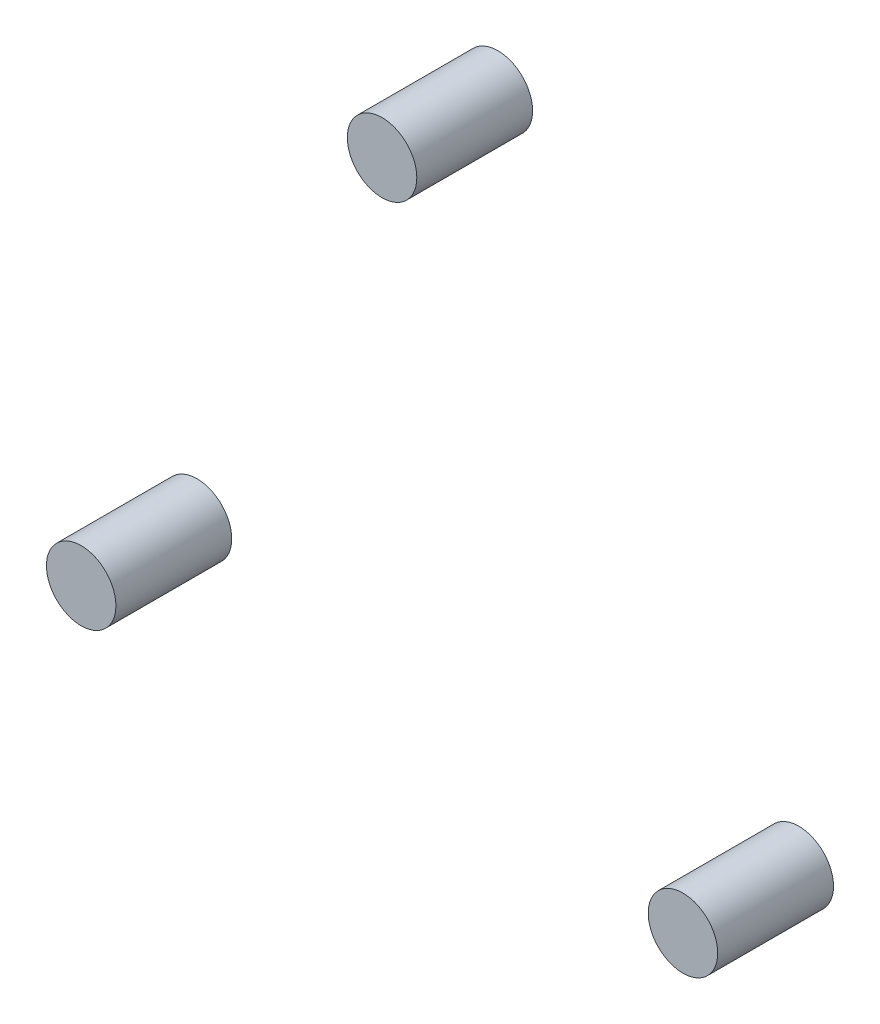
ISO-10303-21;
HEADER;
FILE_DESCRIPTION(('STEP AP214'),'2;1');
FILE_NAME('part.step','',(''),(''),'','','');
FILE_SCHEMA(('AUTOMOTIVE_DESIGN { 1 0 10303 214 1 1 1 1 }'));
ENDSEC;
DATA;
#1=APPLICATION_CONTEXT('core data for automotive mechanical design processes');
#2=APPLICATION_PROTOCOL_DEFINITION('international standard','automotive_design',2000,#1);
#3=PRODUCT_CONTEXT('',#1,'mechanical');
#4=PRODUCT('Part','Part','',(#3));
#5=PRODUCT_RELATED_PRODUCT_CATEGORY('part','',(#4));
#6=PRODUCT_DEFINITION_FORMATION('','',#4);
#7=PRODUCT_DEFINITION_CONTEXT('part definition',#1,'design');
#8=PRODUCT_DEFINITION('design','',#6,#7);
#9=PRODUCT_DEFINITION_SHAPE('','',#8);
#10=(LENGTH_UNIT() NAMED_UNIT(*) SI_UNIT(.MILLI.,.METRE.));
#11=(NAMED_UNIT(*) PLANE_ANGLE_UNIT() SI_UNIT($,.RADIAN.));
#12=(NAMED_UNIT(*) SI_UNIT($,.STERADIAN.) SOLID_ANGLE_UNIT());
#13=UNCERTAINTY_MEASURE_WITH_UNIT(LENGTH_MEASURE(1.E-05),#10,'distance_accuracy_value','');
#14=(GEOMETRIC_REPRESENTATION_CONTEXT(3) GLOBAL_UNCERTAINTY_ASSIGNED_CONTEXT((#13)) GLOBAL_UNIT_ASSIGNED_CONTEXT((#10,
#11,#12)) REPRESENTATION_CONTEXT('',''));
#15=CARTESIAN_POINT('',(0.,0.,0.));
#16=DIRECTION('',(0.,0.,1.));
#17=DIRECTION('',(1.,0.,0.));
#18=AXIS2_PLACEMENT_3D('',#15,#16,#17);
#19=CARTESIAN_POINT('',(-12.9903810567666,-7.49999999999997,-5.));
#20=DIRECTION('',(0.,0.,1.));
#21=DIRECTION('',(1.,0.,0.));
#22=AXIS2_PLACEMENT_3D('',#19,#20,#21);
#23=CYLINDRICAL_SURFACE('',#22,1.5);
#24=CARTESIAN_POINT('',(-12.9903810567666,-7.49999999999997,-5.));
#25=DIRECTION('',(0.,0.,1.));
#26=DIRECTION('',(1.,0.,0.));
#27=AXIS2_PLACEMENT_3D('',#24,#25,#26);
#28=CIRCLE('',#27,1.5);
#29=CARTESIAN_POINT('',(-11.4903810567666,-7.49999999999997,-5.));
#30=VERTEX_POINT('',#29);
#31=EDGE_CURVE('E11',#30,#30,#28,.T.);
#32=ORIENTED_EDGE('',*,*,#31,.T.);
#33=EDGE_LOOP('',(#32));
#34=FACE_BOUND('',#33,.T.);
#35=CARTESIAN_POINT('',(-12.9903810567666,-7.49999999999997,0.));
#36=DIRECTION('',(0.,0.,1.));
#37=DIRECTION('',(1.,0.,0.));
#38=AXIS2_PLACEMENT_3D('',#35,#36,#37);
#39=CIRCLE('',#38,1.5);
#40=CARTESIAN_POINT('',(-11.4903810567666,-7.49999999999997,0.));
#41=VERTEX_POINT('',#40);
#42=EDGE_CURVE('E43',#41,#41,#39,.T.);
#43=ORIENTED_EDGE('',*,*,#42,.F.);
#44=EDGE_LOOP('',(#43));
#45=FACE_BOUND('',#44,.T.);
#46=ADVANCED_FACE('F40',(#34,#45),#23,.T.);
#47=CARTESIAN_POINT('',(-12.9903810567666,-7.49999999999997,-5.));
#48=DIRECTION('',(0.,0.,1.));
#49=DIRECTION('',(1.,0.,0.));
#50=AXIS2_PLACEMENT_3D('',#47,#48,#49);
#51=PLANE('',#50);
#52=ORIENTED_EDGE('',*,*,#31,.F.);
#53=EDGE_LOOP('',(#52));
#54=FACE_BOUND('',#53,.T.);
#55=ADVANCED_FACE('F55',(#54),#51,.F.);
#56=CARTESIAN_POINT('',(-12.9903810567666,-7.49999999999997,0.));
#57=DIRECTION('',(0.,0.,1.));
#58=DIRECTION('',(1.,0.,0.));
#59=AXIS2_PLACEMENT_3D('',#56,#57,#58);
#60=PLANE('',#59);
#61=ORIENTED_EDGE('',*,*,#42,.T.);
#62=EDGE_LOOP('',(#61));
#63=FACE_BOUND('',#62,.T.);
#64=ADVANCED_FACE('F52',(#63),#60,.T.);
#65=CLOSED_SHELL('',(#46,#55,#64));
#66=MANIFOLD_SOLID_BREP('B2',#65);
#67=CARTESIAN_POINT('',(12.9903810567666,-7.49999999999997,-5.));
#68=DIRECTION('',(0.,0.,1.));
#69=DIRECTION('',(1.,0.,0.));
#70=AXIS2_PLACEMENT_3D('',#67,#68,#69);
#71=CYLINDRICAL_SURFACE('',#70,1.5);
#72=CARTESIAN_POINT('',(12.9903810567666,-7.49999999999997,-5.));
#73=DIRECTION('',(0.,0.,1.));
#74=DIRECTION('',(1.,0.,0.));
#75=AXIS2_PLACEMENT_3D('',#72,#73,#74);
#76=CIRCLE('',#75,1.5);
#77=CARTESIAN_POINT('',(14.4903810567666,-7.49999999999997,-5.));
#78=VERTEX_POINT('',#77);
#79=EDGE_CURVE('E39',#78,#78,#76,.T.);
#80=ORIENTED_EDGE('',*,*,#79,.T.);
#81=EDGE_LOOP('',(#80));
#82=FACE_BOUND('',#81,.T.);
#83=CARTESIAN_POINT('',(12.9903810567666,-7.49999999999997,0.));
#84=DIRECTION('',(0.,0.,1.));
#85=DIRECTION('',(1.,0.,0.));
#86=AXIS2_PLACEMENT_3D('',#83,#84,#85);
#87=CIRCLE('',#86,1.5);
#88=CARTESIAN_POINT('',(14.4903810567666,-7.49999999999997,0.));
#89=VERTEX_POINT('',#88);
#90=EDGE_CURVE('E91',#89,#89,#87,.T.);
#91=ORIENTED_EDGE('',*,*,#90,.F.);
#92=EDGE_LOOP('',(#91));
#93=FACE_BOUND('',#92,.T.);
#94=ADVANCED_FACE('F88',(#82,#93),#71,.T.);
#95=CARTESIAN_POINT('',(12.9903810567666,-7.49999999999997,-5.));
#96=DIRECTION('',(0.,0.,1.));
#97=DIRECTION('',(1.,0.,0.));
#98=AXIS2_PLACEMENT_3D('',#95,#96,#97);
#99=PLANE('',#98);
#100=ORIENTED_EDGE('',*,*,#79,.F.);
#101=EDGE_LOOP('',(#100));
#102=FACE_BOUND('',#101,.T.);
#103=ADVANCED_FACE('F103',(#102),#99,.F.);
#104=CARTESIAN_POINT('',(12.9903810567666,-7.49999999999997,0.));
#105=DIRECTION('',(0.,0.,1.));
#106=DIRECTION('',(1.,0.,0.));
#107=AXIS2_PLACEMENT_3D('',#104,#105,#106);
#108=PLANE('',#107);
#109=ORIENTED_EDGE('',*,*,#90,.T.);
#110=EDGE_LOOP('',(#109));
#111=FACE_BOUND('',#110,.T.);
#112=ADVANCED_FACE('F100',(#111),#108,.T.);
#113=CLOSED_SHELL('',(#94,#103,#112));
#114=MANIFOLD_SOLID_BREP('B6',#113);
#115=CARTESIAN_POINT('',(0.,15.,-5.));
#116=DIRECTION('',(0.,0.,1.));
#117=DIRECTION('',(1.,0.,0.));
#118=AXIS2_PLACEMENT_3D('',#115,#116,#117);
#119=CYLINDRICAL_SURFACE('',#118,1.5);
#120=CARTESIAN_POINT('',(0.,15.,-5.));
#121=DIRECTION('',(0.,0.,1.));
#122=DIRECTION('',(1.,0.,0.));
#123=AXIS2_PLACEMENT_3D('',#120,#121,#122);
#124=CIRCLE('',#123,1.5);
#125=CARTESIAN_POINT('',(1.5,15.,-5.));
#126=VERTEX_POINT('',#125);
#127=EDGE_CURVE('E87',#126,#126,#124,.T.);
#128=ORIENTED_EDGE('',*,*,#127,.T.);
#129=EDGE_LOOP('',(#128));
#130=FACE_BOUND('',#129,.T.);
#131=CARTESIAN_POINT('',(0.,15.,0.));
#132=DIRECTION('',(0.,0.,1.));
#133=DIRECTION('',(1.,0.,0.));
#134=AXIS2_PLACEMENT_3D('',#131,#132,#133);
#135=CIRCLE('',#134,1.5);
#136=CARTESIAN_POINT('',(1.5,15.,0.));
#137=VERTEX_POINT('',#136);
#138=EDGE_CURVE('E132',#137,#137,#135,.T.);
#139=ORIENTED_EDGE('',*,*,#138,.F.);
#140=EDGE_LOOP('',(#139));
#141=FACE_BOUND('',#140,.T.);
#142=ADVANCED_FACE('F129',(#130,#141),#119,.T.);
#143=CARTESIAN_POINT('',(0.,15.,-5.));
#144=DIRECTION('',(0.,0.,1.));
#145=DIRECTION('',(1.,0.,0.));
#146=AXIS2_PLACEMENT_3D('',#143,#144,#145);
#147=PLANE('',#146);
#148=ORIENTED_EDGE('',*,*,#127,.F.);
#149=EDGE_LOOP('',(#148));
#150=FACE_BOUND('',#149,.T.);
#151=ADVANCED_FACE('F144',(#150),#147,.F.);
#152=CARTESIAN_POINT('',(0.,15.,0.));
#153=DIRECTION('',(0.,0.,1.));
#154=DIRECTION('',(1.,0.,0.));
#155=AXIS2_PLACEMENT_3D('',#152,#153,#154);
#156=PLANE('',#155);
#157=ORIENTED_EDGE('',*,*,#138,.T.);
#158=EDGE_LOOP('',(#157));
#159=FACE_BOUND('',#158,.T.);
#160=ADVANCED_FACE('F141',(#159),#156,.T.);
#161=CLOSED_SHELL('',(#142,#151,#160));
#162=MANIFOLD_SOLID_BREP('B34',#161);
#163=ADVANCED_BREP_SHAPE_REPRESENTATION('',(#18,#66,#114,#162),#14);
#164=SHAPE_DEFINITION_REPRESENTATION(#9,#163);
ENDSEC;
END-ISO-10303-21;
